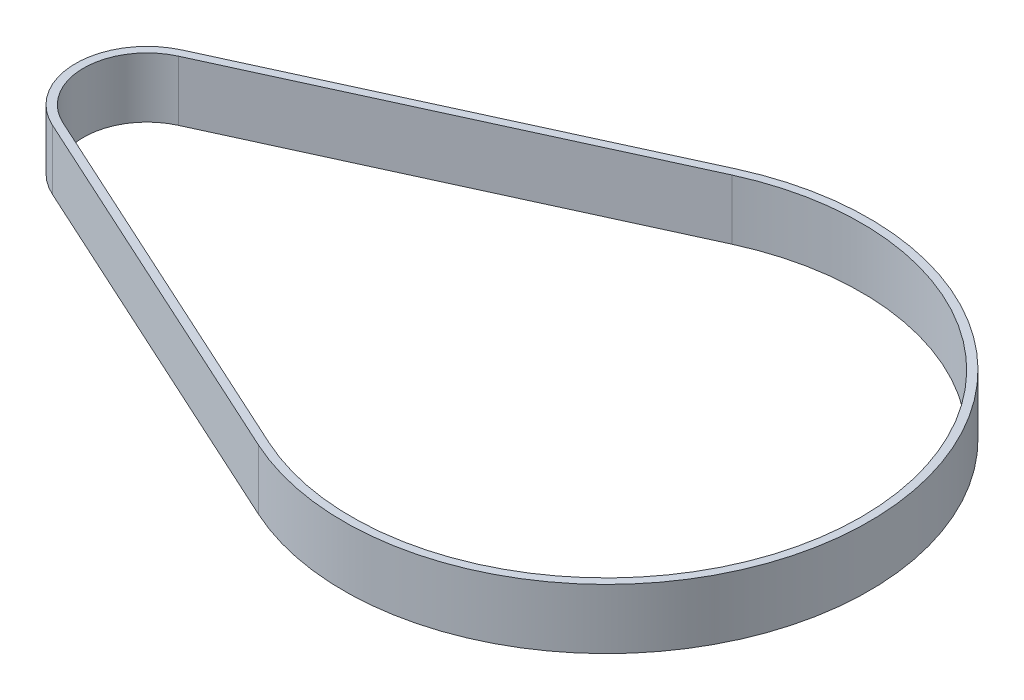
ISO-10303-21;
HEADER;
FILE_DESCRIPTION(('STEP AP214'),'2;1');
FILE_NAME('part.step','',(''),(''),'','','');
FILE_SCHEMA(('AUTOMOTIVE_DESIGN { 1 0 10303 214 1 1 1 1 }'));
ENDSEC;
DATA;
#1=APPLICATION_CONTEXT('core data for automotive mechanical design processes');
#2=APPLICATION_PROTOCOL_DEFINITION('international standard','automotive_design',2000,#1);
#3=PRODUCT_CONTEXT('',#1,'mechanical');
#4=PRODUCT('Part','Part','',(#3));
#5=PRODUCT_RELATED_PRODUCT_CATEGORY('part','',(#4));
#6=PRODUCT_DEFINITION_FORMATION('','',#4);
#7=PRODUCT_DEFINITION_CONTEXT('part definition',#1,'design');
#8=PRODUCT_DEFINITION('design','',#6,#7);
#9=PRODUCT_DEFINITION_SHAPE('','',#8);
#10=(LENGTH_UNIT() NAMED_UNIT(*) SI_UNIT(.MILLI.,.METRE.));
#11=(NAMED_UNIT(*) PLANE_ANGLE_UNIT() SI_UNIT($,.RADIAN.));
#12=(NAMED_UNIT(*) SI_UNIT($,.STERADIAN.) SOLID_ANGLE_UNIT());
#13=UNCERTAINTY_MEASURE_WITH_UNIT(LENGTH_MEASURE(1.E-05),#10,'distance_accuracy_value','');
#14=(GEOMETRIC_REPRESENTATION_CONTEXT(3) GLOBAL_UNCERTAINTY_ASSIGNED_CONTEXT((#13)) GLOBAL_UNIT_ASSIGNED_CONTEXT((#10,
#11,#12)) REPRESENTATION_CONTEXT('',''));
#15=CARTESIAN_POINT('',(0.,0.,0.));
#16=DIRECTION('',(0.,0.,1.));
#17=DIRECTION('',(1.,0.,0.));
#18=AXIS2_PLACEMENT_3D('',#15,#16,#17);
#19=CARTESIAN_POINT('',(-46.,6.,0.));
#20=DIRECTION('',(0.,1.,0.));
#21=DIRECTION('',(0.,0.,1.));
#22=AXIS2_PLACEMENT_3D('',#19,#20,#21);
#23=PLANE('',#22);
#24=CARTESIAN_POINT('',(-46.,6.,0.));
#25=DIRECTION('',(0.,1.,0.));
#26=DIRECTION('',(0.,0.,1.));
#27=AXIS2_PLACEMENT_3D('',#24,#25,#26);
#28=CIRCLE('',#27,7.14999999999999);
#29=CARTESIAN_POINT('',(-48.9765760869565,6.,-6.50096106730063));
#30=VERTEX_POINT('',#29);
#31=CARTESIAN_POINT('',(-48.9765760869565,6.,6.50096106730063));
#32=VERTEX_POINT('',#31);
#33=EDGE_CURVE('E133',#30,#32,#28,.T.);
#34=ORIENTED_EDGE('',*,*,#33,.T.);
#35=DIRECTION('',(0.909225324097991,0.,0.416304347826087));
#36=VECTOR('',#35,1.);
#37=CARTESIAN_POINT('',(-48.9765760869565,6.,6.50096106730063));
#38=LINE('',#37,#36);
#39=CARTESIAN_POINT('',(-10.9488043478261,6.,23.9126260237772));
#40=VERTEX_POINT('',#39);
#41=EDGE_CURVE('E136',#32,#40,#38,.T.);
#42=ORIENTED_EDGE('',*,*,#41,.T.);
#43=CARTESIAN_POINT('',(0.,6.,0.));
#44=DIRECTION('',(0.,1.,0.));
#45=DIRECTION('',(0.,0.,1.));
#46=AXIS2_PLACEMENT_3D('',#43,#44,#45);
#47=CIRCLE('',#46,26.3);
#48=CARTESIAN_POINT('',(-10.9488043478261,6.,-23.9126260237772));
#49=VERTEX_POINT('',#48);
#50=EDGE_CURVE('E139',#40,#49,#47,.T.);
#51=ORIENTED_EDGE('',*,*,#50,.T.);
#52=DIRECTION('',(-0.909225324097991,0.,0.416304347826087));
#53=VECTOR('',#52,1.);
#54=CARTESIAN_POINT('',(-48.9765760869565,6.,-6.50096106730063));
#55=LINE('',#54,#53);
#56=EDGE_CURVE('E141',#49,#30,#55,.T.);
#57=ORIENTED_EDGE('',*,*,#56,.T.);
#58=EDGE_LOOP('',(#34,#42,#51,#57));
#59=FACE_BOUND('',#58,.T.);
#60=DIRECTION('',(0.909225324097991,0.,0.416304347826087));
#61=VECTOR('',#60,1.);
#62=CARTESIAN_POINT('',(-48.6435326086956,6.,5.77358080802223));
#63=LINE('',#62,#61);
#64=CARTESIAN_POINT('',(-48.6435326086956,6.,5.77358080802223));
#65=VERTEX_POINT('',#64);
#66=CARTESIAN_POINT('',(-10.6157608695652,6.,23.1852457644988));
#67=VERTEX_POINT('',#66);
#68=EDGE_CURVE('E105',#65,#67,#63,.T.);
#69=ORIENTED_EDGE('',*,*,#68,.F.);
#70=CARTESIAN_POINT('',(-46.,6.,0.));
#71=DIRECTION('',(0.,1.,0.));
#72=DIRECTION('',(0.,0.,1.));
#73=AXIS2_PLACEMENT_3D('',#70,#71,#72);
#74=CIRCLE('',#73,6.34999999999999);
#75=CARTESIAN_POINT('',(-48.6435326086956,6.,-5.77358080802223));
#76=VERTEX_POINT('',#75);
#77=EDGE_CURVE('E97',#76,#65,#74,.T.);
#78=ORIENTED_EDGE('',*,*,#77,.F.);
#79=DIRECTION('',(-0.909225324097991,0.,0.416304347826087));
#80=VECTOR('',#79,1.);
#81=CARTESIAN_POINT('',(-48.6435326086956,6.,-5.77358080802223));
#82=LINE('',#81,#80);
#83=CARTESIAN_POINT('',(-10.6157608695652,6.,-23.1852457644988));
#84=VERTEX_POINT('',#83);
#85=EDGE_CURVE('E119',#84,#76,#82,.T.);
#86=ORIENTED_EDGE('',*,*,#85,.F.);
#87=CARTESIAN_POINT('',(0.,6.,0.));
#88=DIRECTION('',(0.,1.,0.));
#89=DIRECTION('',(0.,0.,1.));
#90=AXIS2_PLACEMENT_3D('',#87,#88,#89);
#91=CIRCLE('',#90,25.5);
#92=EDGE_CURVE('E117',#67,#84,#91,.T.);
#93=ORIENTED_EDGE('',*,*,#92,.F.);
#94=EDGE_LOOP('',(#69,#78,#86,#93));
#95=FACE_BOUND('',#94,.T.);
#96=ADVANCED_FACE('F32',(#59,#95),#23,.T.);
#97=CARTESIAN_POINT('',(-46.,0.,0.));
#98=DIRECTION('',(0.,1.,0.));
#99=DIRECTION('',(0.,0.,1.));
#100=AXIS2_PLACEMENT_3D('',#97,#98,#99);
#101=PLANE('',#100);
#102=CARTESIAN_POINT('',(-46.,0.,0.));
#103=DIRECTION('',(0.,1.,0.));
#104=DIRECTION('',(0.,0.,1.));
#105=AXIS2_PLACEMENT_3D('',#102,#103,#104);
#106=CIRCLE('',#105,7.14999999999999);
#107=CARTESIAN_POINT('',(-48.9765760869565,0.,-6.50096106730063));
#108=VERTEX_POINT('',#107);
#109=CARTESIAN_POINT('',(-48.9765760869565,0.,6.50096106730063));
#110=VERTEX_POINT('',#109);
#111=EDGE_CURVE('E113',#108,#110,#106,.T.);
#112=ORIENTED_EDGE('',*,*,#111,.F.);
#113=DIRECTION('',(-0.909225324097991,0.,0.416304347826087));
#114=VECTOR('',#113,1.);
#115=CARTESIAN_POINT('',(-48.9765760869565,0.,-6.50096106730063));
#116=LINE('',#115,#114);
#117=CARTESIAN_POINT('',(-10.9488043478261,0.,-23.9126260237772));
#118=VERTEX_POINT('',#117);
#119=EDGE_CURVE('E137',#118,#108,#116,.T.);
#120=ORIENTED_EDGE('',*,*,#119,.F.);
#121=CARTESIAN_POINT('',(0.,0.,0.));
#122=DIRECTION('',(0.,1.,0.));
#123=DIRECTION('',(0.,0.,1.));
#124=AXIS2_PLACEMENT_3D('',#121,#122,#123);
#125=CIRCLE('',#124,26.3);
#126=CARTESIAN_POINT('',(-10.9488043478261,0.,23.9126260237772));
#127=VERTEX_POINT('',#126);
#128=EDGE_CURVE('E148',#127,#118,#125,.T.);
#129=ORIENTED_EDGE('',*,*,#128,.F.);
#130=DIRECTION('',(0.909225324097991,0.,0.416304347826087));
#131=VECTOR('',#130,1.);
#132=CARTESIAN_POINT('',(-48.9765760869565,0.,6.50096106730063));
#133=LINE('',#132,#131);
#134=EDGE_CURVE('E146',#110,#127,#133,.T.);
#135=ORIENTED_EDGE('',*,*,#134,.F.);
#136=EDGE_LOOP('',(#112,#120,#129,#135));
#137=FACE_BOUND('',#136,.T.);
#138=CARTESIAN_POINT('',(-46.,0.,0.));
#139=DIRECTION('',(0.,1.,0.));
#140=DIRECTION('',(0.,0.,1.));
#141=AXIS2_PLACEMENT_3D('',#138,#139,#140);
#142=CIRCLE('',#141,6.34999999999999);
#143=CARTESIAN_POINT('',(-48.6435326086956,0.,-5.77358080802223));
#144=VERTEX_POINT('',#143);
#145=CARTESIAN_POINT('',(-48.6435326086956,0.,5.77358080802223));
#146=VERTEX_POINT('',#145);
#147=EDGE_CURVE('E55',#144,#146,#142,.T.);
#148=ORIENTED_EDGE('',*,*,#147,.T.);
#149=DIRECTION('',(0.909225324097991,0.,0.416304347826087));
#150=VECTOR('',#149,1.);
#151=CARTESIAN_POINT('',(-48.6435326086956,0.,5.77358080802223));
#152=LINE('',#151,#150);
#153=CARTESIAN_POINT('',(-10.6157608695652,0.,23.1852457644988));
#154=VERTEX_POINT('',#153);
#155=EDGE_CURVE('E112',#146,#154,#152,.T.);
#156=ORIENTED_EDGE('',*,*,#155,.T.);
#157=CARTESIAN_POINT('',(0.,0.,0.));
#158=DIRECTION('',(0.,1.,0.));
#159=DIRECTION('',(0.,0.,1.));
#160=AXIS2_PLACEMENT_3D('',#157,#158,#159);
#161=CIRCLE('',#160,25.5);
#162=CARTESIAN_POINT('',(-10.6157608695652,0.,-23.1852457644988));
#163=VERTEX_POINT('',#162);
#164=EDGE_CURVE('E125',#154,#163,#161,.T.);
#165=ORIENTED_EDGE('',*,*,#164,.T.);
#166=DIRECTION('',(-0.909225324097991,0.,0.416304347826087));
#167=VECTOR('',#166,1.);
#168=CARTESIAN_POINT('',(-48.6435326086956,0.,-5.77358080802223));
#169=LINE('',#168,#167);
#170=EDGE_CURVE('E106',#163,#144,#169,.T.);
#171=ORIENTED_EDGE('',*,*,#170,.T.);
#172=EDGE_LOOP('',(#148,#156,#165,#171));
#173=FACE_BOUND('',#172,.T.);
#174=ADVANCED_FACE('F166',(#137,#173),#101,.F.);
#175=CARTESIAN_POINT('',(-46.,6.,0.));
#176=DIRECTION('',(0.,-1.,0.));
#177=DIRECTION('',(0.,0.,-1.));
#178=AXIS2_PLACEMENT_3D('',#175,#176,#177);
#179=CYLINDRICAL_SURFACE('',#178,7.14999999999999);
#180=ORIENTED_EDGE('',*,*,#111,.T.);
#181=DIRECTION('',(0.,-1.,0.));
#182=VECTOR('',#181,1.);
#183=CARTESIAN_POINT('',(-48.9765760869565,6.,6.50096106730063));
#184=LINE('',#183,#182);
#185=EDGE_CURVE('E11',#32,#110,#184,.T.);
#186=ORIENTED_EDGE('',*,*,#185,.F.);
#187=ORIENTED_EDGE('',*,*,#33,.F.);
#188=DIRECTION('',(0.,-1.,0.));
#189=VECTOR('',#188,1.);
#190=CARTESIAN_POINT('',(-48.9765760869565,6.,-6.50096106730063));
#191=LINE('',#190,#189);
#192=EDGE_CURVE('E143',#30,#108,#191,.T.);
#193=ORIENTED_EDGE('',*,*,#192,.T.);
#194=EDGE_LOOP('',(#180,#186,#187,#193));
#195=FACE_BOUND('',#194,.T.);
#196=ADVANCED_FACE('F34',(#195),#179,.T.);
#197=CARTESIAN_POINT('',(-48.9765760869565,6.,6.50096106730063));
#198=DIRECTION('',(0.416304347826087,0.,-0.909225324097991));
#199=DIRECTION('',(-0.909225324097991,0.,-0.416304347826087));
#200=AXIS2_PLACEMENT_3D('',#197,#198,#199);
#201=PLANE('',#200);
#202=ORIENTED_EDGE('',*,*,#134,.T.);
#203=DIRECTION('',(0.,-1.,0.));
#204=VECTOR('',#203,1.);
#205=CARTESIAN_POINT('',(-10.9488043478261,6.,23.9126260237772));
#206=LINE('',#205,#204);
#207=EDGE_CURVE('E40',#40,#127,#206,.T.);
#208=ORIENTED_EDGE('',*,*,#207,.F.);
#209=ORIENTED_EDGE('',*,*,#41,.F.);
#210=ORIENTED_EDGE('',*,*,#185,.T.);
#211=EDGE_LOOP('',(#202,#208,#209,#210));
#212=FACE_BOUND('',#211,.T.);
#213=ADVANCED_FACE('F176',(#212),#201,.F.);
#214=CARTESIAN_POINT('',(0.,6.,0.));
#215=DIRECTION('',(0.,-1.,0.));
#216=DIRECTION('',(0.,0.,-1.));
#217=AXIS2_PLACEMENT_3D('',#214,#215,#216);
#218=CYLINDRICAL_SURFACE('',#217,26.3);
#219=ORIENTED_EDGE('',*,*,#128,.T.);
#220=DIRECTION('',(0.,-1.,0.));
#221=VECTOR('',#220,1.);
#222=CARTESIAN_POINT('',(-10.9488043478261,6.,-23.9126260237772));
#223=LINE('',#222,#221);
#224=EDGE_CURVE('E153',#49,#118,#223,.T.);
#225=ORIENTED_EDGE('',*,*,#224,.F.);
#226=ORIENTED_EDGE('',*,*,#50,.F.);
#227=ORIENTED_EDGE('',*,*,#207,.T.);
#228=EDGE_LOOP('',(#219,#225,#226,#227));
#229=FACE_BOUND('',#228,.T.);
#230=ADVANCED_FACE('F160',(#229),#218,.T.);
#231=CARTESIAN_POINT('',(-48.9765760869565,6.,-6.50096106730063));
#232=DIRECTION('',(0.416304347826087,0.,0.909225324097991));
#233=DIRECTION('',(0.909225324097991,0.,-0.416304347826087));
#234=AXIS2_PLACEMENT_3D('',#231,#232,#233);
#235=PLANE('',#234);
#236=ORIENTED_EDGE('',*,*,#119,.T.);
#237=ORIENTED_EDGE('',*,*,#192,.F.);
#238=ORIENTED_EDGE('',*,*,#56,.F.);
#239=ORIENTED_EDGE('',*,*,#224,.T.);
#240=EDGE_LOOP('',(#236,#237,#238,#239));
#241=FACE_BOUND('',#240,.T.);
#242=ADVANCED_FACE('F170',(#241),#235,.F.);
#243=CARTESIAN_POINT('',(-46.,6.,0.));
#244=DIRECTION('',(0.,-1.,0.));
#245=DIRECTION('',(0.,0.,-1.));
#246=AXIS2_PLACEMENT_3D('',#243,#244,#245);
#247=CYLINDRICAL_SURFACE('',#246,6.34999999999999);
#248=ORIENTED_EDGE('',*,*,#147,.F.);
#249=DIRECTION('',(0.,-1.,0.));
#250=VECTOR('',#249,1.);
#251=CARTESIAN_POINT('',(-48.6435326086956,6.,-5.77358080802223));
#252=LINE('',#251,#250);
#253=EDGE_CURVE('E101',#76,#144,#252,.T.);
#254=ORIENTED_EDGE('',*,*,#253,.F.);
#255=ORIENTED_EDGE('',*,*,#77,.T.);
#256=DIRECTION('',(0.,-1.,0.));
#257=VECTOR('',#256,1.);
#258=CARTESIAN_POINT('',(-48.6435326086956,6.,5.77358080802223));
#259=LINE('',#258,#257);
#260=EDGE_CURVE('E100',#65,#146,#259,.T.);
#261=ORIENTED_EDGE('',*,*,#260,.T.);
#262=EDGE_LOOP('',(#248,#254,#255,#261));
#263=FACE_BOUND('',#262,.T.);
#264=ADVANCED_FACE('F99',(#263),#247,.F.);
#265=CARTESIAN_POINT('',(-48.6435326086956,6.,5.77358080802223));
#266=DIRECTION('',(0.416304347826087,0.,-0.909225324097991));
#267=DIRECTION('',(-0.909225324097991,0.,-0.416304347826087));
#268=AXIS2_PLACEMENT_3D('',#265,#266,#267);
#269=PLANE('',#268);
#270=ORIENTED_EDGE('',*,*,#155,.F.);
#271=ORIENTED_EDGE('',*,*,#260,.F.);
#272=ORIENTED_EDGE('',*,*,#68,.T.);
#273=DIRECTION('',(0.,-1.,0.));
#274=VECTOR('',#273,1.);
#275=CARTESIAN_POINT('',(-10.6157608695652,6.,23.1852457644988));
#276=LINE('',#275,#274);
#277=EDGE_CURVE('E114',#67,#154,#276,.T.);
#278=ORIENTED_EDGE('',*,*,#277,.T.);
#279=EDGE_LOOP('',(#270,#271,#272,#278));
#280=FACE_BOUND('',#279,.T.);
#281=ADVANCED_FACE('F109',(#280),#269,.T.);
#282=CARTESIAN_POINT('',(0.,6.,0.));
#283=DIRECTION('',(0.,-1.,0.));
#284=DIRECTION('',(0.,0.,-1.));
#285=AXIS2_PLACEMENT_3D('',#282,#283,#284);
#286=CYLINDRICAL_SURFACE('',#285,25.5);
#287=ORIENTED_EDGE('',*,*,#164,.F.);
#288=ORIENTED_EDGE('',*,*,#277,.F.);
#289=ORIENTED_EDGE('',*,*,#92,.T.);
#290=DIRECTION('',(0.,-1.,0.));
#291=VECTOR('',#290,1.);
#292=CARTESIAN_POINT('',(-10.6157608695652,6.,-23.1852457644988));
#293=LINE('',#292,#291);
#294=EDGE_CURVE('E47',#84,#163,#293,.T.);
#295=ORIENTED_EDGE('',*,*,#294,.T.);
#296=EDGE_LOOP('',(#287,#288,#289,#295));
#297=FACE_BOUND('',#296,.T.);
#298=ADVANCED_FACE('F199',(#297),#286,.F.);
#299=CARTESIAN_POINT('',(-48.6435326086956,6.,-5.77358080802223));
#300=DIRECTION('',(0.416304347826087,0.,0.909225324097991));
#301=DIRECTION('',(0.909225324097991,0.,-0.416304347826087));
#302=AXIS2_PLACEMENT_3D('',#299,#300,#301);
#303=PLANE('',#302);
#304=ORIENTED_EDGE('',*,*,#170,.F.);
#305=ORIENTED_EDGE('',*,*,#294,.F.);
#306=ORIENTED_EDGE('',*,*,#85,.T.);
#307=ORIENTED_EDGE('',*,*,#253,.T.);
#308=EDGE_LOOP('',(#304,#305,#306,#307));
#309=FACE_BOUND('',#308,.T.);
#310=ADVANCED_FACE('F203',(#309),#303,.T.);
#311=CLOSED_SHELL('',(#96,#174,#196,#213,#230,#242,#264,#281,#298,#310));
#312=MANIFOLD_SOLID_BREP('B2',#311);
#313=ADVANCED_BREP_SHAPE_REPRESENTATION('',(#18,#312),#14);
#314=SHAPE_DEFINITION_REPRESENTATION(#9,#313);
ENDSEC;
END-ISO-10303-21;
